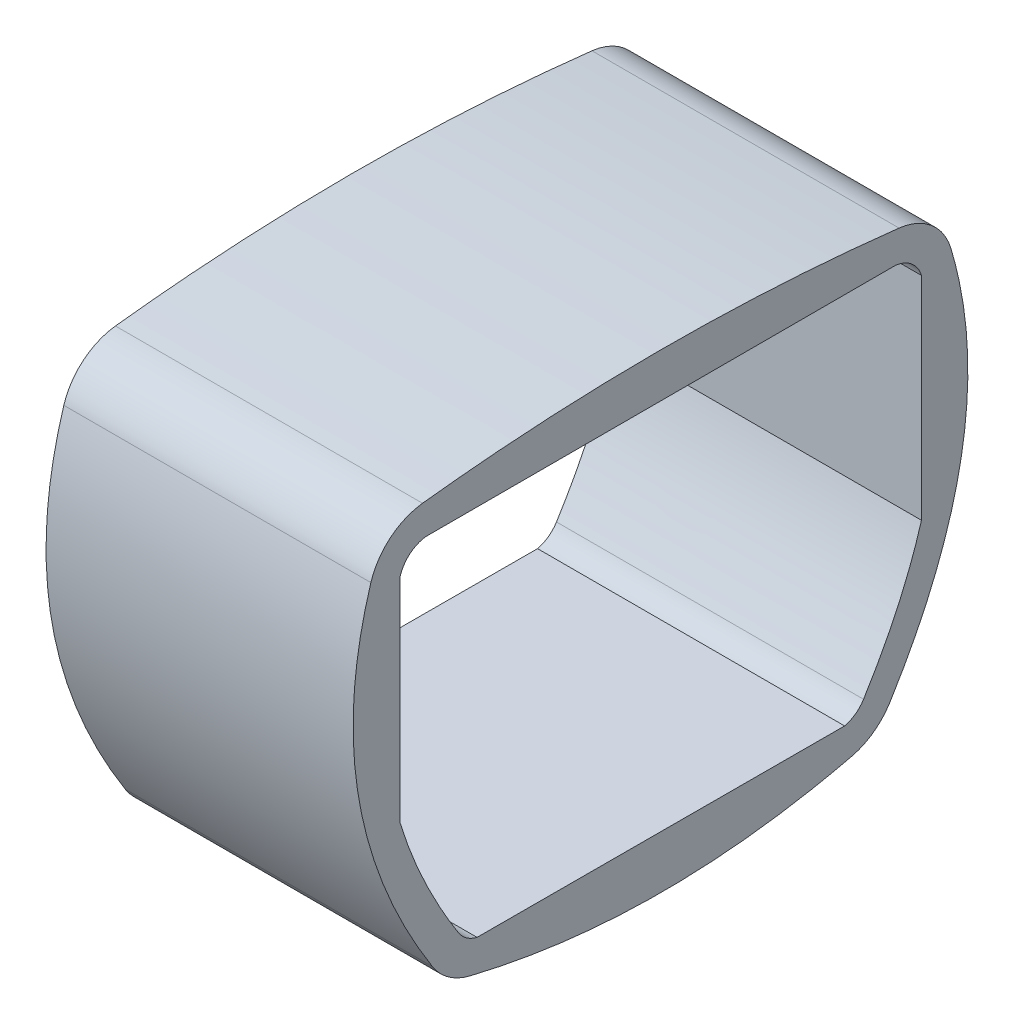
ISO-10303-21;
HEADER;
FILE_DESCRIPTION(('STEP AP214'),'2;1');
FILE_NAME('part.step','',(''),(''),'','','');
FILE_SCHEMA(('AUTOMOTIVE_DESIGN { 1 0 10303 214 1 1 1 1 }'));
ENDSEC;
DATA;
#1=APPLICATION_CONTEXT('core data for automotive mechanical design processes');
#2=APPLICATION_PROTOCOL_DEFINITION('international standard','automotive_design',2000,#1);
#3=PRODUCT_CONTEXT('',#1,'mechanical');
#4=PRODUCT('Part','Part','',(#3));
#5=PRODUCT_RELATED_PRODUCT_CATEGORY('part','',(#4));
#6=PRODUCT_DEFINITION_FORMATION('','',#4);
#7=PRODUCT_DEFINITION_CONTEXT('part definition',#1,'design');
#8=PRODUCT_DEFINITION('design','',#6,#7);
#9=PRODUCT_DEFINITION_SHAPE('','',#8);
#10=(LENGTH_UNIT() NAMED_UNIT(*) SI_UNIT(.MILLI.,.METRE.));
#11=(NAMED_UNIT(*) PLANE_ANGLE_UNIT() SI_UNIT($,.RADIAN.));
#12=(NAMED_UNIT(*) SI_UNIT($,.STERADIAN.) SOLID_ANGLE_UNIT());
#13=UNCERTAINTY_MEASURE_WITH_UNIT(LENGTH_MEASURE(1.E-05),#10,'distance_accuracy_value','');
#14=(GEOMETRIC_REPRESENTATION_CONTEXT(3) GLOBAL_UNCERTAINTY_ASSIGNED_CONTEXT((#13)) GLOBAL_UNIT_ASSIGNED_CONTEXT((#10,
#11,#12)) REPRESENTATION_CONTEXT('',''));
#15=CARTESIAN_POINT('',(0.,0.,0.));
#16=DIRECTION('',(0.,0.,1.));
#17=DIRECTION('',(1.,0.,0.));
#18=AXIS2_PLACEMENT_3D('',#15,#16,#17);
#19=CARTESIAN_POINT('',(0.,114.617007202796,-94.9506624520817));
#20=DIRECTION('',(-1.,0.,0.));
#21=DIRECTION('',(0.,0.,1.));
#22=AXIS2_PLACEMENT_3D('',#19,#20,#21);
#23=CYLINDRICAL_SURFACE('',#22,25.4);
#24=DIRECTION('',(-1.,0.,0.));
#25=VECTOR('',#24,1.);
#26=CARTESIAN_POINT('',(0.,121.875579845419,-119.291433253184));
#27=LINE('',#26,#25);
#28=CARTESIAN_POINT('',(0.,121.875579845419,-119.291433253183));
#29=VERTEX_POINT('',#28);
#30=CARTESIAN_POINT('',(127.,121.875579845419,-119.291433253184));
#31=VERTEX_POINT('',#30);
#32=EDGE_CURVE('E291',#29,#31,#27,.F.);
#33=ORIENTED_EDGE('',*,*,#32,.F.);
#34=CARTESIAN_POINT('',(0.,114.617007202796,-94.9506624520817));
#35=DIRECTION('',(-1.,0.,0.));
#36=DIRECTION('',(0.,0.,1.));
#37=AXIS2_PLACEMENT_3D('',#34,#35,#36);
#38=CIRCLE('',#37,25.4);
#39=CARTESIAN_POINT('',(0.,139.850013219048,-97.8584807723703));
#40=VERTEX_POINT('',#39);
#41=EDGE_CURVE('E43',#40,#29,#38,.T.);
#42=ORIENTED_EDGE('',*,*,#41,.F.);
#43=DIRECTION('',(-1.,0.,0.));
#44=VECTOR('',#43,1.);
#45=CARTESIAN_POINT('',(127.,139.850013219048,-97.8584807723703));
#46=LINE('',#45,#44);
#47=CARTESIAN_POINT('',(127.,139.850013219048,-97.8584807723703));
#48=VERTEX_POINT('',#47);
#49=EDGE_CURVE('E294',#48,#40,#46,.T.);
#50=ORIENTED_EDGE('',*,*,#49,.F.);
#51=CARTESIAN_POINT('',(127.,114.617007202796,-94.9506624520817));
#52=DIRECTION('',(-1.,0.,0.));
#53=DIRECTION('',(0.,0.,1.));
#54=AXIS2_PLACEMENT_3D('',#51,#52,#53);
#55=CIRCLE('',#54,25.4);
#56=EDGE_CURVE('E11',#31,#48,#55,.F.);
#57=ORIENTED_EDGE('',*,*,#56,.F.);
#58=EDGE_LOOP('',(#33,#42,#50,#57));
#59=FACE_BOUND('',#58,.T.);
#60=ADVANCED_FACE('F33',(#59),#23,.T.);
#61=CARTESIAN_POINT('',(0.,-14.861321521796,-72.3920260893014));
#62=DIRECTION('',(-1.,0.,0.));
#63=DIRECTION('',(0.,0.,1.));
#64=AXIS2_PLACEMENT_3D('',#61,#62,#63);
#65=CYLINDRICAL_SURFACE('',#64,25.4);
#66=DIRECTION('',(-1.,0.,0.));
#67=VECTOR('',#66,1.);
#68=CARTESIAN_POINT('',(0.,-39.5661872145053,-78.293687813358));
#69=LINE('',#68,#67);
#70=CARTESIAN_POINT('',(0.,-39.5661872145053,-78.2936878133582));
#71=VERTEX_POINT('',#70);
#72=CARTESIAN_POINT('',(127.,-39.5661872145053,-78.293687813358));
#73=VERTEX_POINT('',#72);
#74=EDGE_CURVE('E281',#71,#73,#69,.F.);
#75=ORIENTED_EDGE('',*,*,#74,.F.);
#76=CARTESIAN_POINT('',(0.,-14.861321521796,-72.3920260893014));
#77=DIRECTION('',(-1.,0.,0.));
#78=DIRECTION('',(0.,0.,1.));
#79=AXIS2_PLACEMENT_3D('',#76,#77,#78);
#80=CIRCLE('',#79,25.4);
#81=CARTESIAN_POINT('',(0.,-28.2948910164763,-93.9489092274454));
#82=VERTEX_POINT('',#81);
#83=EDGE_CURVE('E287',#82,#71,#80,.T.);
#84=ORIENTED_EDGE('',*,*,#83,.F.);
#85=DIRECTION('',(-1.,0.,0.));
#86=VECTOR('',#85,1.);
#87=CARTESIAN_POINT('',(127.,-28.2948910164763,-93.9489092274454));
#88=LINE('',#87,#86);
#89=CARTESIAN_POINT('',(127.,-28.2948910164763,-93.9489092274454));
#90=VERTEX_POINT('',#89);
#91=EDGE_CURVE('E284',#90,#82,#88,.T.);
#92=ORIENTED_EDGE('',*,*,#91,.F.);
#93=CARTESIAN_POINT('',(127.,-14.861321521796,-72.3920260893014));
#94=DIRECTION('',(-1.,0.,0.));
#95=DIRECTION('',(0.,0.,1.));
#96=AXIS2_PLACEMENT_3D('',#93,#94,#95);
#97=CIRCLE('',#96,25.4);
#98=EDGE_CURVE('E289',#73,#90,#97,.F.);
#99=ORIENTED_EDGE('',*,*,#98,.F.);
#100=EDGE_LOOP('',(#75,#84,#92,#99));
#101=FACE_BOUND('',#100,.T.);
#102=ADVANCED_FACE('F472',(#101),#65,.T.);
#103=CARTESIAN_POINT('',(127.,-14.5858447535305,73.6949102423429));
#104=DIRECTION('',(-1.,0.,0.));
#105=DIRECTION('',(0.,0.,1.));
#106=AXIS2_PLACEMENT_3D('',#103,#104,#105);
#107=CYLINDRICAL_SURFACE('',#106,25.4);
#108=DIRECTION('',(-1.,0.,0.));
#109=VECTOR('',#108,1.);
#110=CARTESIAN_POINT('',(127.,-39.2691218272979,79.6862233621544));
#111=LINE('',#110,#109);
#112=CARTESIAN_POINT('',(127.,-39.2691218272979,79.6862233621545));
#113=VERTEX_POINT('',#112);
#114=CARTESIAN_POINT('',(0.,-39.2691218272979,79.6862233621544));
#115=VERTEX_POINT('',#114);
#116=EDGE_CURVE('E271',#113,#115,#111,.T.);
#117=ORIENTED_EDGE('',*,*,#116,.F.);
#118=CARTESIAN_POINT('',(127.,-14.5858447535305,73.6949102423429));
#119=DIRECTION('',(-1.,0.,0.));
#120=DIRECTION('',(0.,0.,1.));
#121=AXIS2_PLACEMENT_3D('',#118,#119,#120);
#122=CIRCLE('',#121,25.4);
#123=CARTESIAN_POINT('',(127.,-28.1688921515844,95.1579208275851));
#124=VERTEX_POINT('',#123);
#125=EDGE_CURVE('E277',#124,#113,#122,.F.);
#126=ORIENTED_EDGE('',*,*,#125,.F.);
#127=DIRECTION('',(-1.,0.,0.));
#128=VECTOR('',#127,1.);
#129=CARTESIAN_POINT('',(0.,-28.1688921515844,95.1579208275851));
#130=LINE('',#129,#128);
#131=CARTESIAN_POINT('',(0.,-28.1688921515844,95.1579208275851));
#132=VERTEX_POINT('',#131);
#133=EDGE_CURVE('E274',#132,#124,#130,.F.);
#134=ORIENTED_EDGE('',*,*,#133,.F.);
#135=CARTESIAN_POINT('',(0.,-14.5858447535305,73.6949102423429));
#136=DIRECTION('',(-1.,0.,0.));
#137=DIRECTION('',(0.,0.,1.));
#138=AXIS2_PLACEMENT_3D('',#135,#136,#137);
#139=CIRCLE('',#138,25.4);
#140=EDGE_CURVE('E279',#115,#132,#139,.T.);
#141=ORIENTED_EDGE('',*,*,#140,.F.);
#142=EDGE_LOOP('',(#117,#126,#134,#141));
#143=FACE_BOUND('',#142,.T.);
#144=ADVANCED_FACE('F469',(#143),#107,.T.);
#145=CARTESIAN_POINT('',(127.,114.596712889543,96.3280230198601));
#146=DIRECTION('',(-1.,0.,0.));
#147=DIRECTION('',(0.,0.,1.));
#148=AXIS2_PLACEMENT_3D('',#145,#146,#147);
#149=CYLINDRICAL_SURFACE('',#148,25.4);
#150=DIRECTION('',(-1.,0.,0.));
#151=VECTOR('',#150,1.);
#152=CARTESIAN_POINT('',(127.,122.091184600306,120.597198815024));
#153=LINE('',#152,#151);
#154=CARTESIAN_POINT('',(127.,122.091184600306,120.597198815024));
#155=VERTEX_POINT('',#154);
#156=CARTESIAN_POINT('',(0.,122.091184600306,120.597198815024));
#157=VERTEX_POINT('',#156);
#158=EDGE_CURVE('E219',#155,#157,#153,.T.);
#159=ORIENTED_EDGE('',*,*,#158,.F.);
#160=CARTESIAN_POINT('',(127.,114.596712889543,96.3280230198601));
#161=DIRECTION('',(-1.,0.,0.));
#162=DIRECTION('',(0.,0.,1.));
#163=AXIS2_PLACEMENT_3D('',#160,#161,#162);
#164=CIRCLE('',#163,25.4);
#165=CARTESIAN_POINT('',(127.,139.829137270999,99.2408841277921));
#166=VERTEX_POINT('',#165);
#167=EDGE_CURVE('E266',#166,#155,#164,.F.);
#168=ORIENTED_EDGE('',*,*,#167,.F.);
#169=DIRECTION('',(-1.,0.,0.));
#170=VECTOR('',#169,1.);
#171=CARTESIAN_POINT('',(0.,139.829137270999,99.2408841277921));
#172=LINE('',#171,#170);
#173=CARTESIAN_POINT('',(0.,139.829137270999,99.2408841277921));
#174=VERTEX_POINT('',#173);
#175=EDGE_CURVE('E263',#174,#166,#172,.F.);
#176=ORIENTED_EDGE('',*,*,#175,.F.);
#177=CARTESIAN_POINT('',(0.,114.596712889543,96.3280230198601));
#178=DIRECTION('',(-1.,0.,0.));
#179=DIRECTION('',(0.,0.,1.));
#180=AXIS2_PLACEMENT_3D('',#177,#178,#179);
#181=CIRCLE('',#180,25.4);
#182=EDGE_CURVE('E268',#157,#174,#181,.T.);
#183=ORIENTED_EDGE('',*,*,#182,.F.);
#184=EDGE_LOOP('',(#159,#168,#176,#183));
#185=FACE_BOUND('',#184,.T.);
#186=ADVANCED_FACE('F465',(#185),#149,.T.);
#187=CARTESIAN_POINT('',(127.,137.877770050103,114.901391535941));
#188=CARTESIAN_POINT('',(127.,52.1413830448743,150.307927624443));
#189=CARTESIAN_POINT('',(127.,-36.7354426244945,89.5173219878917));
#190=B_SPLINE_CURVE_WITH_KNOTS('',2,(#187,#188,#189),.UNSPECIFIED.,.F.,.F.,(3,3),(0.,1.),.UNSPECIFIED.);
#191=DIRECTION('',(-1.,0.,0.));
#192=VECTOR('',#191,1.);
#193=SURFACE_OF_LINEAR_EXTRUSION('',#190,#192);
#194=CARTESIAN_POINT('',(0.,137.877770050103,114.901391535941));
#195=CARTESIAN_POINT('',(0.,52.1413830448743,150.307927624443));
#196=CARTESIAN_POINT('',(0.,-36.7354426244945,89.5173219878917));
#197=B_SPLINE_CURVE_WITH_KNOTS('',2,(#194,#195,#196),.UNSPECIFIED.,.F.,.F.,(3,3),(0.,1.),.UNSPECIFIED.);
#198=EDGE_CURVE('E225',#157,#132,#197,.T.);
#199=ORIENTED_EDGE('',*,*,#198,.T.);
#200=ORIENTED_EDGE('',*,*,#133,.T.);
#201=EDGE_CURVE('E257',#155,#124,#190,.T.);
#202=ORIENTED_EDGE('',*,*,#201,.F.);
#203=ORIENTED_EDGE('',*,*,#158,.T.);
#204=EDGE_LOOP('',(#199,#200,#202,#203));
#205=FACE_BOUND('',#204,.T.);
#206=ADVANCED_FACE('F461',(#205),#193,.F.);
#207=CARTESIAN_POINT('',(127.,-36.7354426244945,89.5173219878917));
#208=CARTESIAN_POINT('',(127.,-60.9751769020343,0.634104951901947));
#209=CARTESIAN_POINT('',(127.,-37.0280016654939,-88.2824373179283));
#210=B_SPLINE_CURVE_WITH_KNOTS('',2,(#207,#208,#209),.UNSPECIFIED.,.F.,.F.,(3,3),(0.,1.),.UNSPECIFIED.);
#211=DIRECTION('',(-1.,0.,0.));
#212=VECTOR('',#211,1.);
#213=SURFACE_OF_LINEAR_EXTRUSION('',#210,#212);
#214=CARTESIAN_POINT('',(0.,-36.7354426244945,89.5173219878917));
#215=CARTESIAN_POINT('',(0.,-60.9751769020343,0.634104951901947));
#216=CARTESIAN_POINT('',(0.,-37.0280016654939,-88.2824373179283));
#217=B_SPLINE_CURVE_WITH_KNOTS('',2,(#214,#215,#216),.UNSPECIFIED.,.F.,.F.,(3,3),(0.,1.),.UNSPECIFIED.);
#218=EDGE_CURVE('E233',#115,#71,#217,.T.);
#219=ORIENTED_EDGE('',*,*,#218,.T.);
#220=ORIENTED_EDGE('',*,*,#74,.T.);
#221=EDGE_CURVE('E453',#113,#73,#210,.T.);
#222=ORIENTED_EDGE('',*,*,#221,.F.);
#223=ORIENTED_EDGE('',*,*,#116,.T.);
#224=EDGE_LOOP('',(#219,#220,#222,#223));
#225=FACE_BOUND('',#224,.T.);
#226=ADVANCED_FACE('F464',(#225),#213,.F.);
#227=CARTESIAN_POINT('',(127.,-37.0280016654939,-88.2824373179283));
#228=CARTESIAN_POINT('',(127.,51.8147222777629,-148.206005144733));
#229=CARTESIAN_POINT('',(127.,137.877770050103,-113.698608464059));
#230=B_SPLINE_CURVE_WITH_KNOTS('',2,(#227,#228,#229),.UNSPECIFIED.,.F.,.F.,(3,3),(0.,1.),.UNSPECIFIED.);
#231=DIRECTION('',(-1.,0.,0.));
#232=VECTOR('',#231,1.);
#233=SURFACE_OF_LINEAR_EXTRUSION('',#230,#232);
#234=CARTESIAN_POINT('',(0.,-37.0280016654939,-88.2824373179283));
#235=CARTESIAN_POINT('',(0.,51.8147222777629,-148.206005144733));
#236=CARTESIAN_POINT('',(0.,137.877770050103,-113.698608464059));
#237=B_SPLINE_CURVE_WITH_KNOTS('',2,(#234,#235,#236),.UNSPECIFIED.,.F.,.F.,(3,3),(0.,1.),.UNSPECIFIED.);
#238=EDGE_CURVE('E242',#82,#29,#237,.T.);
#239=ORIENTED_EDGE('',*,*,#238,.T.);
#240=ORIENTED_EDGE('',*,*,#32,.T.);
#241=EDGE_CURVE('E220',#90,#31,#230,.T.);
#242=ORIENTED_EDGE('',*,*,#241,.F.);
#243=ORIENTED_EDGE('',*,*,#91,.T.);
#244=EDGE_LOOP('',(#239,#240,#242,#243));
#245=FACE_BOUND('',#244,.T.);
#246=ADVANCED_FACE('F210',(#245),#233,.F.);
#247=CARTESIAN_POINT('',(127.,137.877770050103,-113.698608464059));
#248=CARTESIAN_POINT('',(127.,153.168104445763,0.596034429289006));
#249=CARTESIAN_POINT('',(127.,137.877770050103,114.901391535941));
#250=B_SPLINE_CURVE_WITH_KNOTS('',2,(#247,#248,#249),.UNSPECIFIED.,.F.,.F.,(3,3),(0.,1.),.UNSPECIFIED.);
#251=DIRECTION('',(-1.,0.,0.));
#252=VECTOR('',#251,1.);
#253=SURFACE_OF_LINEAR_EXTRUSION('',#250,#252);
#254=EDGE_CURVE('E214',#48,#166,#250,.T.);
#255=ORIENTED_EDGE('',*,*,#254,.F.);
#256=ORIENTED_EDGE('',*,*,#49,.T.);
#257=CARTESIAN_POINT('',(0.,137.877770050103,-113.698608464059));
#258=CARTESIAN_POINT('',(0.,153.168104445763,0.596034429289006));
#259=CARTESIAN_POINT('',(0.,137.877770050103,114.901391535941));
#260=B_SPLINE_CURVE_WITH_KNOTS('',2,(#257,#258,#259),.UNSPECIFIED.,.F.,.F.,(3,3),(0.,1.),.UNSPECIFIED.);
#261=EDGE_CURVE('E250',#40,#174,#260,.T.);
#262=ORIENTED_EDGE('',*,*,#261,.T.);
#263=ORIENTED_EDGE('',*,*,#175,.T.);
#264=EDGE_LOOP('',(#255,#256,#262,#263));
#265=FACE_BOUND('',#264,.T.);
#266=ADVANCED_FACE('F205',(#265),#253,.F.);
#267=CARTESIAN_POINT('',(127.,51.3562733788392,126.25864219318));
#268=DIRECTION('',(-1.,0.,0.));
#269=DIRECTION('',(0.,0.,1.));
#270=AXIS2_PLACEMENT_3D('',#267,#268,#269);
#271=PLANE('',#270);
#272=DIRECTION('',(0.,1.,0.));
#273=VECTOR('',#272,1.);
#274=CARTESIAN_POINT('',(127.,118.246293451614,-107.12104787436));
#275=LINE('',#274,#273);
#276=CARTESIAN_POINT('',(127.,30.5559194754228,-107.12104787436));
#277=VERTEX_POINT('',#276);
#278=CARTESIAN_POINT('',(127.,118.246293451614,-107.12104787436));
#279=VERTEX_POINT('',#278);
#280=EDGE_CURVE('E369',#277,#279,#275,.T.);
#281=ORIENTED_EDGE('',*,*,#280,.F.);
#282=CARTESIAN_POINT('',(127.,-21.5781062799655,-83.1704676517065));
#283=CARTESIAN_POINT('',(127.,-16.3709684109525,-86.4153916971266));
#284=CARTESIAN_POINT('',(127.,-11.0830465950968,-89.4600797807661));
#285=CARTESIAN_POINT('',(127.,-0.326289828774494,-95.1010337437885));
#286=CARTESIAN_POINT('',(127.,5.14250791225482,-97.6973918527239));
#287=CARTESIAN_POINT('',(127.,16.2845483406303,-102.383358498966));
#288=CARTESIAN_POINT('',(127.,21.9577411303166,-104.473090715602));
#289=CARTESIAN_POINT('',(127.,28.6807107836133,-106.56353953547));
#290=CARTESIAN_POINT('',(127.,29.6167619067656,-106.846143616486));
#291=CARTESIAN_POINT('',(127.,30.5559194754228,-107.12104787436));
#292=B_SPLINE_CURVE_WITH_KNOTS('',3,(#282,#283,#284,#285,#286,#287,#288,#289,#290,#291),
.UNSPECIFIED.,.F.,.F.,(4,2,2,2,4),(0.,0.125,0.25,0.375,0.395143118856035),.UNSPECIFIED.);
#293=CARTESIAN_POINT('',(127.,-21.578106279931,-83.1704676516513));
#294=VERTEX_POINT('',#293);
#295=EDGE_CURVE('E51',#294,#277,#292,.T.);
#296=ORIENTED_EDGE('',*,*,#295,.F.);
#297=CARTESIAN_POINT('',(127.,-14.861321521796,-72.3920260893014));
#298=DIRECTION('',(1.,0.,0.));
#299=DIRECTION('',(0.,0.,-1.));
#300=AXIS2_PLACEMENT_3D('',#297,#298,#299);
#301=CIRCLE('',#300,12.7000000000042);
#302=CARTESIAN_POINT('',(127.,-27.2137543657014,-75.3428569613203));
#303=VERTEX_POINT('',#302);
#304=EDGE_CURVE('E182',#303,#294,#301,.T.);
#305=ORIENTED_EDGE('',*,*,#304,.F.);
#306=DIRECTION('',(0.,-0.00188294495194373,-0.999998227257583));
#307=VECTOR('',#306,1.);
#308=CARTESIAN_POINT('',(127.,-26.9274832904142,76.6905668022487));
#309=LINE('',#308,#307);
#310=CARTESIAN_POINT('',(127.,-26.9274832904109,76.6905668022479));
#311=VERTEX_POINT('',#310);
#312=EDGE_CURVE('E375',#311,#303,#309,.T.);
#313=ORIENTED_EDGE('',*,*,#312,.F.);
#314=CARTESIAN_POINT('',(127.,-14.5858447535305,73.6949102423429));
#315=DIRECTION('',(1.,0.,0.));
#316=DIRECTION('',(0.,0.,-1.));
#317=AXIS2_PLACEMENT_3D('',#314,#315,#316);
#318=CIRCLE('',#317,12.6999999999966);
#319=CARTESIAN_POINT('',(127.,-21.3773685013997,84.4264155040457));
#320=VERTEX_POINT('',#319);
#321=EDGE_CURVE('E378',#320,#311,#318,.T.);
#322=ORIENTED_EDGE('',*,*,#321,.F.);
#323=CARTESIAN_POINT('',(127.,29.857159557474,108.462615216461));
#324=CARTESIAN_POINT('',(127.,29.3304014348296,108.303399666854));
#325=CARTESIAN_POINT('',(127.,28.8041782420962,108.141583016451));
#326=CARTESIAN_POINT('',(127.,25.3626220696542,107.06532925774));
#327=CARTESIAN_POINT('',(127.,22.4627253484997,106.07391495403));
#328=CARTESIAN_POINT('',(127.,16.6957035972585,103.939463913503));
#329=CARTESIAN_POINT('',(127.,13.8468367168927,102.803256230839));
#330=CARTESIAN_POINT('',(127.,5.39618610611368,99.2035801439709));
#331=CARTESIAN_POINT('',(127.,-0.109908529683792,96.5495782687651));
#332=CARTESIAN_POINT('',(127.,-10.9019419385699,90.8032062712902));
#333=CARTESIAN_POINT('',(127.,-16.1878008741642,87.7106771788143));
#334=CARTESIAN_POINT('',(127.,-21.3773685013997,84.4264155040457));
#335=B_SPLINE_CURVE_WITH_KNOTS('',3,(#323,#324,#325,#326,#327,#328,#329,#330,#331,#332,#333,
#334),.UNSPECIFIED.,.F.,.F.,(4,2,2,2,2,4),(0.613732053554068,0.625,0.6875,0.75,0.875,1.),.UNSPECIFIED.);
#336=CARTESIAN_POINT('',(127.,29.8571455168321,108.462610917442));
#337=VERTEX_POINT('',#336);
#338=EDGE_CURVE('E331',#337,#320,#335,.T.);
#339=ORIENTED_EDGE('',*,*,#338,.F.);
#340=DIRECTION('',(0.,-1.,0.));
#341=VECTOR('',#340,1.);
#342=CARTESIAN_POINT('',(127.,118.343948744924,108.462610917442));
#343=LINE('',#342,#341);
#344=CARTESIAN_POINT('',(127.,118.343948744923,108.462610917437));
#345=VERTEX_POINT('',#344);
#346=EDGE_CURVE('E337',#345,#337,#343,.T.);
#347=ORIENTED_EDGE('',*,*,#346,.F.);
#348=CARTESIAN_POINT('',(127.,114.596712889543,96.3280230198601));
#349=DIRECTION('',(1.,0.,0.));
#350=DIRECTION('',(0.,0.,-1.));
#351=AXIS2_PLACEMENT_3D('',#348,#349,#350);
#352=CIRCLE('',#351,12.699999999995);
#353=CARTESIAN_POINT('',(127.,127.212925066586,97.7844536922819));
#354=VERTEX_POINT('',#353);
#355=EDGE_CURVE('E372',#354,#345,#352,.T.);
#356=ORIENTED_EDGE('',*,*,#355,.F.);
#357=DIRECTION('',(0.,-0.000106005703402674,0.999999994381395));
#358=VECTOR('',#357,1.);
#359=CARTESIAN_POINT('',(127.,127.212925066586,97.7844536922819));
#360=LINE('',#359,#358);
#361=CARTESIAN_POINT('',(127.,127.233510210974,-96.404571612232));
#362=VERTEX_POINT('',#361);
#363=EDGE_CURVE('E368',#362,#354,#360,.T.);
#364=ORIENTED_EDGE('',*,*,#363,.F.);
#365=CARTESIAN_POINT('',(127.,114.617007202796,-94.9506624520817));
#366=DIRECTION('',(1.,0.,0.));
#367=DIRECTION('',(0.,0.,-1.));
#368=AXIS2_PLACEMENT_3D('',#365,#366,#367);
#369=CIRCLE('',#368,12.7000000000523);
#370=EDGE_CURVE('E365',#279,#362,#369,.T.);
#371=ORIENTED_EDGE('',*,*,#370,.F.);
#372=EDGE_LOOP('',(#281,#296,#305,#313,#322,#339,#347,#356,#364,#371));
#373=FACE_BOUND('',#372,.T.);
#374=ORIENTED_EDGE('',*,*,#241,.T.);
#375=ORIENTED_EDGE('',*,*,#56,.T.);
#376=ORIENTED_EDGE('',*,*,#254,.T.);
#377=ORIENTED_EDGE('',*,*,#167,.T.);
#378=ORIENTED_EDGE('',*,*,#201,.T.);
#379=ORIENTED_EDGE('',*,*,#125,.T.);
#380=ORIENTED_EDGE('',*,*,#221,.T.);
#381=ORIENTED_EDGE('',*,*,#98,.T.);
#382=EDGE_LOOP('',(#374,#375,#376,#377,#378,#379,#380,#381));
#383=FACE_BOUND('',#382,.T.);
#384=ADVANCED_FACE('F202',(#373,#383),#271,.F.);
#385=CARTESIAN_POINT('',(0.,51.3562733788392,126.25864219318));
#386=DIRECTION('',(-1.,0.,0.));
#387=DIRECTION('',(0.,0.,1.));
#388=AXIS2_PLACEMENT_3D('',#385,#386,#387);
#389=PLANE('',#388);
#390=CARTESIAN_POINT('',(0.,30.5559194754228,-107.12104787436));
#391=CARTESIAN_POINT('',(0.,29.6167619067656,-106.846143616486));
#392=CARTESIAN_POINT('',(0.,28.6807107836133,-106.56353953547));
#393=CARTESIAN_POINT('',(0.,21.9577411303166,-104.473090715602));
#394=CARTESIAN_POINT('',(0.,16.2845483406303,-102.383358498966));
#395=CARTESIAN_POINT('',(0.,5.14250791225482,-97.6973918527239));
#396=CARTESIAN_POINT('',(0.,-0.326289828774494,-95.1010337437885));
#397=CARTESIAN_POINT('',(0.,-11.0830465950968,-89.4600797807661));
#398=CARTESIAN_POINT('',(0.,-16.3709684109525,-86.4153916971266));
#399=CARTESIAN_POINT('',(0.,-21.5781062799655,-83.1704676517065));
#400=B_SPLINE_CURVE_WITH_KNOTS('',3,(#390,#391,#392,#393,#394,#395,#396,#397,#398,#399),
.UNSPECIFIED.,.F.,.F.,(4,2,2,2,4),(0.,0.0201431188560344,0.145143118856034,0.270143118856035,
0.395143118856035),.UNSPECIFIED.);
#401=CARTESIAN_POINT('',(0.,-21.578106279931,-83.1704676516513));
#402=VERTEX_POINT('',#401);
#403=CARTESIAN_POINT('',(0.,30.5559194754228,-107.12104787436));
#404=VERTEX_POINT('',#403);
#405=EDGE_CURVE('E163',#402,#404,#400,.F.);
#406=ORIENTED_EDGE('',*,*,#405,.T.);
#407=DIRECTION('',(0.,1.,0.));
#408=VECTOR('',#407,1.);
#409=CARTESIAN_POINT('',(0.,118.246293451614,-107.12104787436));
#410=LINE('',#409,#408);
#411=CARTESIAN_POINT('',(0.,118.246293451614,-107.12104787436));
#412=VERTEX_POINT('',#411);
#413=EDGE_CURVE('E173',#404,#412,#410,.T.);
#414=ORIENTED_EDGE('',*,*,#413,.T.);
#415=CARTESIAN_POINT('',(0.,114.617007202796,-94.9506624520817));
#416=DIRECTION('',(1.,0.,0.));
#417=DIRECTION('',(0.,0.,-1.));
#418=AXIS2_PLACEMENT_3D('',#415,#416,#417);
#419=CIRCLE('',#418,12.7000000000523);
#420=CARTESIAN_POINT('',(0.,127.233510210974,-96.404571612232));
#421=VERTEX_POINT('',#420);
#422=EDGE_CURVE('E60',#412,#421,#419,.T.);
#423=ORIENTED_EDGE('',*,*,#422,.T.);
#424=DIRECTION('',(0.,-0.000106005703402674,0.999999994381395));
#425=VECTOR('',#424,1.);
#426=CARTESIAN_POINT('',(0.,127.212925066586,97.7844536922819));
#427=LINE('',#426,#425);
#428=CARTESIAN_POINT('',(0.,127.212925066586,97.7844536922819));
#429=VERTEX_POINT('',#428);
#430=EDGE_CURVE('E313',#421,#429,#427,.T.);
#431=ORIENTED_EDGE('',*,*,#430,.T.);
#432=CARTESIAN_POINT('',(0.,114.596712889543,96.3280230198601));
#433=DIRECTION('',(1.,0.,0.));
#434=DIRECTION('',(0.,0.,-1.));
#435=AXIS2_PLACEMENT_3D('',#432,#433,#434);
#436=CIRCLE('',#435,12.699999999995);
#437=CARTESIAN_POINT('',(0.,118.343948744923,108.462610917437));
#438=VERTEX_POINT('',#437);
#439=EDGE_CURVE('E311',#429,#438,#436,.T.);
#440=ORIENTED_EDGE('',*,*,#439,.T.);
#441=DIRECTION('',(0.,-1.,0.));
#442=VECTOR('',#441,1.);
#443=CARTESIAN_POINT('',(0.,118.343948744924,108.462610917442));
#444=LINE('',#443,#442);
#445=CARTESIAN_POINT('',(0.,29.8571455168321,108.462610917442));
#446=VERTEX_POINT('',#445);
#447=EDGE_CURVE('E306',#438,#446,#444,.T.);
#448=ORIENTED_EDGE('',*,*,#447,.T.);
#449=CARTESIAN_POINT('',(0.,-21.3773685013997,84.4264155040457));
#450=CARTESIAN_POINT('',(0.,-16.1878008741642,87.7106771788143));
#451=CARTESIAN_POINT('',(0.,-10.9019419385699,90.8032062712902));
#452=CARTESIAN_POINT('',(0.,-0.109908529683792,96.5495782687651));
#453=CARTESIAN_POINT('',(0.,5.39618610611368,99.2035801439709));
#454=CARTESIAN_POINT('',(0.,13.8468367168927,102.803256230839));
#455=CARTESIAN_POINT('',(0.,16.6957035972585,103.939463913503));
#456=CARTESIAN_POINT('',(0.,22.4627253484997,106.07391495403));
#457=CARTESIAN_POINT('',(0.,25.3626220696542,107.06532925774));
#458=CARTESIAN_POINT('',(0.,28.8041735662668,108.141581554212));
#459=CARTESIAN_POINT('',(0.,29.3303920737338,108.303396788263));
#460=CARTESIAN_POINT('',(0.,29.8571455015564,108.462610967981));
#461=B_SPLINE_CURVE_WITH_KNOTS('',3,(#449,#450,#451,#452,#453,#454,#455,#456,#457,#458,#459,
#460),.UNSPECIFIED.,.F.,.F.,(4,2,2,2,2,4),(0.613732153778012,0.738732153778011,
0.863732153778012,0.926232153778012,0.988732153778012,1.),.UNSPECIFIED.);
#462=CARTESIAN_POINT('',(0.,-21.3773685013997,84.4264155040457));
#463=VERTEX_POINT('',#462);
#464=EDGE_CURVE('E301',#446,#463,#461,.F.);
#465=ORIENTED_EDGE('',*,*,#464,.T.);
#466=CARTESIAN_POINT('',(0.,-14.5858447535305,73.6949102423429));
#467=DIRECTION('',(1.,0.,0.));
#468=DIRECTION('',(0.,0.,-1.));
#469=AXIS2_PLACEMENT_3D('',#466,#467,#468);
#470=CIRCLE('',#469,12.6999999999966);
#471=CARTESIAN_POINT('',(0.,-26.9274832904109,76.6905668022479));
#472=VERTEX_POINT('',#471);
#473=EDGE_CURVE('E303',#463,#472,#470,.T.);
#474=ORIENTED_EDGE('',*,*,#473,.T.);
#475=DIRECTION('',(0.,-0.00188294495194373,-0.999998227257583));
#476=VECTOR('',#475,1.);
#477=CARTESIAN_POINT('',(0.,-26.9274832904142,76.6905668022487));
#478=LINE('',#477,#476);
#479=CARTESIAN_POINT('',(0.,-27.2137543657014,-75.3428569613203));
#480=VERTEX_POINT('',#479);
#481=EDGE_CURVE('E309',#472,#480,#478,.T.);
#482=ORIENTED_EDGE('',*,*,#481,.T.);
#483=CARTESIAN_POINT('',(0.,-14.861321521796,-72.3920260893014));
#484=DIRECTION('',(1.,0.,0.));
#485=DIRECTION('',(0.,0.,-1.));
#486=AXIS2_PLACEMENT_3D('',#483,#484,#485);
#487=CIRCLE('',#486,12.7000000000042);
#488=EDGE_CURVE('E170',#480,#402,#487,.T.);
#489=ORIENTED_EDGE('',*,*,#488,.T.);
#490=EDGE_LOOP('',(#406,#414,#423,#431,#440,#448,#465,#474,#482,#489));
#491=FACE_BOUND('',#490,.T.);
#492=ORIENTED_EDGE('',*,*,#261,.F.);
#493=ORIENTED_EDGE('',*,*,#41,.T.);
#494=ORIENTED_EDGE('',*,*,#238,.F.);
#495=ORIENTED_EDGE('',*,*,#83,.T.);
#496=ORIENTED_EDGE('',*,*,#218,.F.);
#497=ORIENTED_EDGE('',*,*,#140,.T.);
#498=ORIENTED_EDGE('',*,*,#198,.F.);
#499=ORIENTED_EDGE('',*,*,#182,.T.);
#500=EDGE_LOOP('',(#492,#493,#494,#495,#496,#497,#498,#499));
#501=FACE_BOUND('',#500,.T.);
#502=ADVANCED_FACE('F178',(#491,#501),#389,.T.);
#503=CARTESIAN_POINT('',(0.,-21.5781062799655,-83.1704676517065));
#504=CARTESIAN_POINT('',(0.,-16.3709684109525,-86.4153916971266));
#505=CARTESIAN_POINT('',(0.,-11.0830465950968,-89.4600797807661));
#506=CARTESIAN_POINT('',(0.,-0.326289828774494,-95.1010337437885));
#507=CARTESIAN_POINT('',(0.,5.14250791225482,-97.6973918527239));
#508=CARTESIAN_POINT('',(0.,16.2845483406303,-102.383358498966));
#509=CARTESIAN_POINT('',(0.,21.9577411303166,-104.473090715602));
#510=CARTESIAN_POINT('',(0.,33.5376384521544,-108.073758863607));
#511=CARTESIAN_POINT('',(0.,39.4442755890042,-109.584861845036));
#512=CARTESIAN_POINT('',(0.,46.9962291106124,-111.055696912637));
#513=CARTESIAN_POINT('',(0.,48.5175435087742,-111.329262647687));
#514=CARTESIAN_POINT('',(0.,51.5571470660483,-111.829681664272));
#515=CARTESIAN_POINT('',(0.,53.0771061237109,-112.056934514232));
#516=CARTESIAN_POINT('',(0.,57.6374573164893,-112.669504498466));
#517=CARTESIAN_POINT('',(0.,60.6783235004598,-112.98562882407));
#518=CARTESIAN_POINT('',(0.,69.8028347370884,-113.654823766641));
#519=CARTESIAN_POINT('',(0.,75.8883930557611,-113.728631502922));
#520=CARTESIAN_POINT('',(0.,85.020613533624,-113.27257522494));
#521=CARTESIAN_POINT('',(0.,88.0653340518693,-113.026115734828));
#522=CARTESIAN_POINT('',(0.,92.6333911519097,-112.513921129568));
#523=CARTESIAN_POINT('',(0.,94.156239563084,-112.319440054897));
#524=CARTESIAN_POINT('',(0.,97.2022626627364,-111.882854030769));
#525=CARTESIAN_POINT('',(0.,98.7271570920255,-111.640437870497));
#526=CARTESIAN_POINT('',(0.,106.329988758893,-110.313041581408));
#527=CARTESIAN_POINT('',(0.,112.327425414536,-108.886091959763));
#528=CARTESIAN_POINT('',(0.,118.246293451612,-107.121047874332));
#529=B_SPLINE_CURVE_WITH_KNOTS('',3,(#503,#504,#505,#506,#507,#508,#509,#510,#511,#512,#513,
#514,#515,#516,#517,#518,#519,#520,#521,#522,#523,#524,#525,#526,#527,#528),.UNSPECIFIED.,.F.,
.F.,(4,2,2,2,2,2,2,2,2,2,2,2,4),(0.,0.125,0.25,0.375,0.5,0.53125,0.5625,0.625,0.75,0.8125,
0.84375,0.875,1.),.UNSPECIFIED.);
#530=DIRECTION('',(1.,0.,0.));
#531=VECTOR('',#530,1.);
#532=SURFACE_OF_LINEAR_EXTRUSION('',#529,#531);
#533=ORIENTED_EDGE('',*,*,#295,.T.);
#534=DIRECTION('',(1.,0.,0.));
#535=VECTOR('',#534,1.);
#536=CARTESIAN_POINT('',(0.,30.5559194754228,-107.12104787436));
#537=LINE('',#536,#535);
#538=EDGE_CURVE('E159',#404,#277,#537,.T.);
#539=ORIENTED_EDGE('',*,*,#538,.F.);
#540=ORIENTED_EDGE('',*,*,#405,.F.);
#541=DIRECTION('',(1.,0.,0.));
#542=VECTOR('',#541,1.);
#543=CARTESIAN_POINT('',(0.,-21.578106279931,-83.1704676516513));
#544=LINE('',#543,#542);
#545=EDGE_CURVE('E234',#402,#294,#544,.T.);
#546=ORIENTED_EDGE('',*,*,#545,.T.);
#547=EDGE_LOOP('',(#533,#539,#540,#546));
#548=FACE_BOUND('',#547,.T.);
#549=ADVANCED_FACE('F161',(#548),#532,.F.);
#550=CARTESIAN_POINT('',(0.,-14.861321521796,-72.3920260893014));
#551=DIRECTION('',(1.,0.,0.));
#552=DIRECTION('',(0.,0.,-1.));
#553=AXIS2_PLACEMENT_3D('',#550,#551,#552);
#554=CYLINDRICAL_SURFACE('',#553,12.7000000000042);
#555=ORIENTED_EDGE('',*,*,#304,.T.);
#556=ORIENTED_EDGE('',*,*,#545,.F.);
#557=ORIENTED_EDGE('',*,*,#488,.F.);
#558=DIRECTION('',(1.,0.,0.));
#559=VECTOR('',#558,1.);
#560=CARTESIAN_POINT('',(0.,-27.2137543657014,-75.3428569613203));
#561=LINE('',#560,#559);
#562=EDGE_CURVE('E379',#480,#303,#561,.T.);
#563=ORIENTED_EDGE('',*,*,#562,.T.);
#564=EDGE_LOOP('',(#555,#556,#557,#563));
#565=FACE_BOUND('',#564,.T.);
#566=ADVANCED_FACE('F422',(#565),#554,.F.);
#567=CARTESIAN_POINT('',(0.,-26.9274832904142,76.6905668022487));
#568=DIRECTION('',(0.,-0.999998227257583,0.00188294495194373));
#569=DIRECTION('',(0.,-0.00188294495194373,-0.999998227257583));
#570=AXIS2_PLACEMENT_3D('',#567,#568,#569);
#571=PLANE('',#570);
#572=ORIENTED_EDGE('',*,*,#312,.T.);
#573=ORIENTED_EDGE('',*,*,#562,.F.);
#574=ORIENTED_EDGE('',*,*,#481,.F.);
#575=DIRECTION('',(1.,0.,0.));
#576=VECTOR('',#575,1.);
#577=CARTESIAN_POINT('',(0.,-26.9274832904109,76.6905668022479));
#578=LINE('',#577,#576);
#579=EDGE_CURVE('E323',#472,#311,#578,.T.);
#580=ORIENTED_EDGE('',*,*,#579,.T.);
#581=EDGE_LOOP('',(#572,#573,#574,#580));
#582=FACE_BOUND('',#581,.T.);
#583=ADVANCED_FACE('F521',(#582),#571,.F.);
#584=CARTESIAN_POINT('',(0.,-14.5858447535305,73.6949102423429));
#585=DIRECTION('',(1.,0.,0.));
#586=DIRECTION('',(0.,0.,-1.));
#587=AXIS2_PLACEMENT_3D('',#584,#585,#586);
#588=CYLINDRICAL_SURFACE('',#587,12.6999999999966);
#589=ORIENTED_EDGE('',*,*,#321,.T.);
#590=ORIENTED_EDGE('',*,*,#579,.F.);
#591=ORIENTED_EDGE('',*,*,#473,.F.);
#592=DIRECTION('',(1.,0.,0.));
#593=VECTOR('',#592,1.);
#594=CARTESIAN_POINT('',(0.,-21.3773685013997,84.4264155040457));
#595=LINE('',#594,#593);
#596=EDGE_CURVE('E321',#463,#320,#595,.T.);
#597=ORIENTED_EDGE('',*,*,#596,.T.);
#598=EDGE_LOOP('',(#589,#590,#591,#597));
#599=FACE_BOUND('',#598,.T.);
#600=ADVANCED_FACE('F351',(#599),#588,.F.);
#601=CARTESIAN_POINT('',(0.,118.343948744924,108.462610917442));
#602=CARTESIAN_POINT('',(0.,106.580919137211,112.095107272981));
#603=CARTESIAN_POINT('',(0.,94.6285506603855,114.316507996303));
#604=CARTESIAN_POINT('',(0.,79.4307600451133,115.175442089283));
#605=CARTESIAN_POINT('',(0.,76.3783380857793,115.251357926539));
#606=CARTESIAN_POINT('',(0.,70.247268554422,115.207736614075));
#607=CARTESIAN_POINT('',(0.,67.1603891345028,115.087091471211));
#608=CARTESIAN_POINT('',(0.,57.9836065582474,114.438468887364));
#609=CARTESIAN_POINT('',(0.,51.9439224184148,113.625947176876));
#610=CARTESIAN_POINT('',(0.,40.0072244258755,111.307168390004));
#611=CARTESIAN_POINT('',(0.,34.1102124991348,109.8009019486));
#612=CARTESIAN_POINT('',(0.,25.3626220696542,107.06532925774));
#613=CARTESIAN_POINT('',(0.,22.4627253484997,106.07391495403));
#614=CARTESIAN_POINT('',(0.,16.6957035972585,103.939463913503));
#615=CARTESIAN_POINT('',(0.,13.8468367168927,102.803256230839));
#616=CARTESIAN_POINT('',(0.,5.39618610611368,99.2035801439709));
#617=CARTESIAN_POINT('',(0.,-0.109908529683792,96.5495782687651));
#618=CARTESIAN_POINT('',(0.,-10.9019419385699,90.8032062712902));
#619=CARTESIAN_POINT('',(0.,-16.1878008741642,87.7106771788143));
#620=CARTESIAN_POINT('',(0.,-21.3773685013997,84.4264155040457));
#621=B_SPLINE_CURVE_WITH_KNOTS('',3,(#601,#602,#603,#604,#605,#606,#607,#608,#609,#610,#611,
#612,#613,#614,#615,#616,#617,#618,#619,#620),.UNSPECIFIED.,.F.,.F.,(4,2,2,2,2,2,2,2,2,4),(0.,
0.249999999999999,0.312499999999999,0.375,0.5,0.625,0.6875,0.75,0.875,1.),.UNSPECIFIED.);
#622=DIRECTION('',(1.,0.,0.));
#623=VECTOR('',#622,1.);
#624=SURFACE_OF_LINEAR_EXTRUSION('',#621,#623);
#625=ORIENTED_EDGE('',*,*,#338,.T.);
#626=ORIENTED_EDGE('',*,*,#596,.F.);
#627=ORIENTED_EDGE('',*,*,#464,.F.);
#628=DIRECTION('',(1.,0.,0.));
#629=VECTOR('',#628,1.);
#630=CARTESIAN_POINT('',(0.,29.8571455168321,108.462610917442));
#631=LINE('',#630,#629);
#632=EDGE_CURVE('E324',#446,#337,#631,.T.);
#633=ORIENTED_EDGE('',*,*,#632,.T.);
#634=EDGE_LOOP('',(#625,#626,#627,#633));
#635=FACE_BOUND('',#634,.T.);
#636=ADVANCED_FACE('F339',(#635),#624,.F.);
#637=CARTESIAN_POINT('',(0.,118.343948744924,108.462610917442));
#638=DIRECTION('',(0.,0.,1.));
#639=DIRECTION('',(0.,-1.,0.));
#640=AXIS2_PLACEMENT_3D('',#637,#638,#639);
#641=PLANE('',#640);
#642=ORIENTED_EDGE('',*,*,#346,.T.);
#643=ORIENTED_EDGE('',*,*,#632,.F.);
#644=ORIENTED_EDGE('',*,*,#447,.F.);
#645=DIRECTION('',(1.,0.,0.));
#646=VECTOR('',#645,1.);
#647=CARTESIAN_POINT('',(0.,118.343948744923,108.462610917437));
#648=LINE('',#647,#646);
#649=EDGE_CURVE('E382',#438,#345,#648,.T.);
#650=ORIENTED_EDGE('',*,*,#649,.T.);
#651=EDGE_LOOP('',(#642,#643,#644,#650));
#652=FACE_BOUND('',#651,.T.);
#653=ADVANCED_FACE('F350',(#652),#641,.F.);
#654=CARTESIAN_POINT('',(0.,114.596712889543,96.3280230198601));
#655=DIRECTION('',(1.,0.,0.));
#656=DIRECTION('',(0.,0.,-1.));
#657=AXIS2_PLACEMENT_3D('',#654,#655,#656);
#658=CYLINDRICAL_SURFACE('',#657,12.699999999995);
#659=ORIENTED_EDGE('',*,*,#355,.T.);
#660=ORIENTED_EDGE('',*,*,#649,.F.);
#661=ORIENTED_EDGE('',*,*,#439,.F.);
#662=DIRECTION('',(1.,0.,0.));
#663=VECTOR('',#662,1.);
#664=CARTESIAN_POINT('',(0.,127.212925066586,97.7844536922819));
#665=LINE('',#664,#663);
#666=EDGE_CURVE('E384',#429,#354,#665,.T.);
#667=ORIENTED_EDGE('',*,*,#666,.T.);
#668=EDGE_LOOP('',(#659,#660,#661,#667));
#669=FACE_BOUND('',#668,.T.);
#670=ADVANCED_FACE('F439',(#669),#658,.F.);
#671=CARTESIAN_POINT('',(0.,127.212925066586,97.7844536922819));
#672=DIRECTION('',(0.,0.999999994381395,0.000106005703402674));
#673=DIRECTION('',(0.,-0.000106005703402674,0.999999994381395));
#674=AXIS2_PLACEMENT_3D('',#671,#672,#673);
#675=PLANE('',#674);
#676=ORIENTED_EDGE('',*,*,#363,.T.);
#677=ORIENTED_EDGE('',*,*,#666,.F.);
#678=ORIENTED_EDGE('',*,*,#430,.F.);
#679=DIRECTION('',(1.,0.,0.));
#680=VECTOR('',#679,1.);
#681=CARTESIAN_POINT('',(0.,127.233510210974,-96.404571612232));
#682=LINE('',#681,#680);
#683=EDGE_CURVE('E386',#421,#362,#682,.T.);
#684=ORIENTED_EDGE('',*,*,#683,.T.);
#685=EDGE_LOOP('',(#676,#677,#678,#684));
#686=FACE_BOUND('',#685,.T.);
#687=ADVANCED_FACE('F436',(#686),#675,.F.);
#688=CARTESIAN_POINT('',(0.,114.617007202796,-94.9506624520817));
#689=DIRECTION('',(1.,0.,0.));
#690=DIRECTION('',(0.,0.,-1.));
#691=AXIS2_PLACEMENT_3D('',#688,#689,#690);
#692=CYLINDRICAL_SURFACE('',#691,12.7000000000523);
#693=ORIENTED_EDGE('',*,*,#370,.T.);
#694=ORIENTED_EDGE('',*,*,#683,.F.);
#695=ORIENTED_EDGE('',*,*,#422,.F.);
#696=DIRECTION('',(1.,0.,0.));
#697=VECTOR('',#696,1.);
#698=CARTESIAN_POINT('',(0.,118.246293451614,-107.12104787436));
#699=LINE('',#698,#697);
#700=EDGE_CURVE('E169',#412,#279,#699,.T.);
#701=ORIENTED_EDGE('',*,*,#700,.T.);
#702=EDGE_LOOP('',(#693,#694,#695,#701));
#703=FACE_BOUND('',#702,.T.);
#704=ADVANCED_FACE('F441',(#703),#692,.F.);
#705=CARTESIAN_POINT('',(0.,118.246293451614,-107.12104787436));
#706=DIRECTION('',(0.,0.,-1.));
#707=DIRECTION('',(0.,1.,0.));
#708=AXIS2_PLACEMENT_3D('',#705,#706,#707);
#709=PLANE('',#708);
#710=ORIENTED_EDGE('',*,*,#280,.T.);
#711=ORIENTED_EDGE('',*,*,#700,.F.);
#712=ORIENTED_EDGE('',*,*,#413,.F.);
#713=ORIENTED_EDGE('',*,*,#538,.T.);
#714=EDGE_LOOP('',(#710,#711,#712,#713));
#715=FACE_BOUND('',#714,.T.);
#716=ADVANCED_FACE('F174',(#715),#709,.F.);
#717=CLOSED_SHELL('',(#60,#102,#144,#186,#206,#226,#246,#266,#384,#502,#549,#566,#583,#600,#636,
#653,#670,#687,#704,#716));
#718=MANIFOLD_SOLID_BREP('B2',#717);
#719=ADVANCED_BREP_SHAPE_REPRESENTATION('',(#18,#718),#14);
#720=SHAPE_DEFINITION_REPRESENTATION(#9,#719);
ENDSEC;
END-ISO-10303-21;
